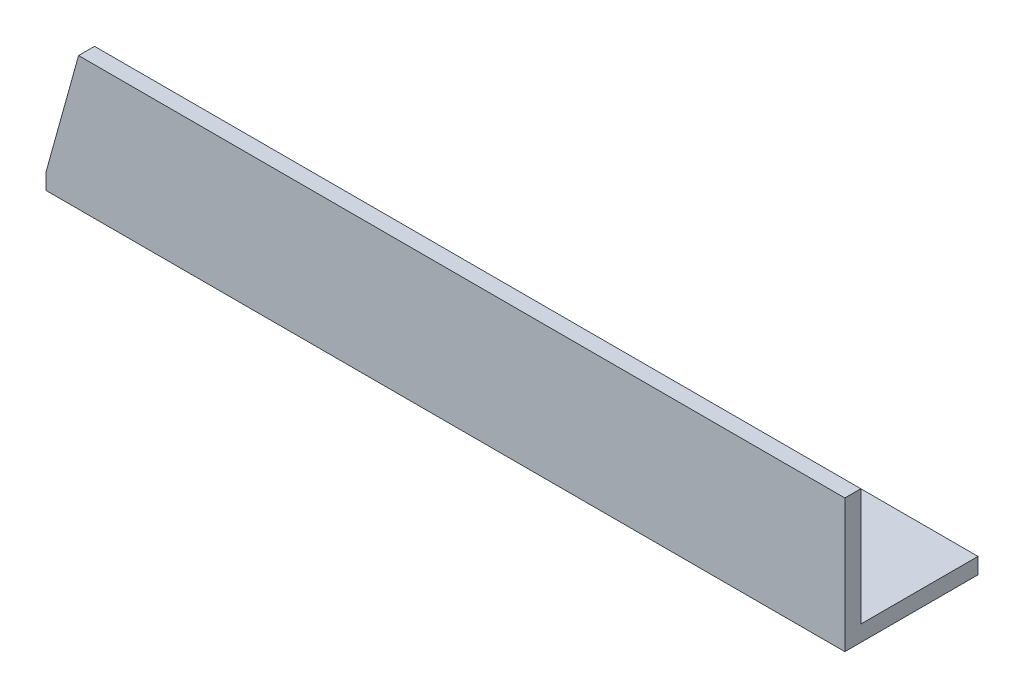
ISO-10303-21;
HEADER;
FILE_DESCRIPTION(('STEP AP214'),'2;1');
FILE_NAME('part.step','',(''),(''),'','','');
FILE_SCHEMA(('AUTOMOTIVE_DESIGN { 1 0 10303 214 1 1 1 1 }'));
ENDSEC;
DATA;
#1=APPLICATION_CONTEXT('core data for automotive mechanical design processes');
#2=APPLICATION_PROTOCOL_DEFINITION('international standard','automotive_design',2000,#1);
#3=PRODUCT_CONTEXT('',#1,'mechanical');
#4=PRODUCT('Part','Part','',(#3));
#5=PRODUCT_RELATED_PRODUCT_CATEGORY('part','',(#4));
#6=PRODUCT_DEFINITION_FORMATION('','',#4);
#7=PRODUCT_DEFINITION_CONTEXT('part definition',#1,'design');
#8=PRODUCT_DEFINITION('design','',#6,#7);
#9=PRODUCT_DEFINITION_SHAPE('','',#8);
#10=(LENGTH_UNIT() NAMED_UNIT(*) SI_UNIT(.MILLI.,.METRE.));
#11=(NAMED_UNIT(*) PLANE_ANGLE_UNIT() SI_UNIT($,.RADIAN.));
#12=(NAMED_UNIT(*) SI_UNIT($,.STERADIAN.) SOLID_ANGLE_UNIT());
#13=UNCERTAINTY_MEASURE_WITH_UNIT(LENGTH_MEASURE(1.E-05),#10,'distance_accuracy_value','');
#14=(GEOMETRIC_REPRESENTATION_CONTEXT(3) GLOBAL_UNCERTAINTY_ASSIGNED_CONTEXT((#13)) GLOBAL_UNIT_ASSIGNED_CONTEXT((#10,
#11,#12)) REPRESENTATION_CONTEXT('',''));
#15=CARTESIAN_POINT('',(0.,0.,0.));
#16=DIRECTION('',(0.,0.,1.));
#17=DIRECTION('',(1.,0.,0.));
#18=AXIS2_PLACEMENT_3D('',#15,#16,#17);
#19=CARTESIAN_POINT('',(300.,0.,0.));
#20=DIRECTION('',(0.,1.,0.));
#21=DIRECTION('',(0.,0.,1.));
#22=AXIS2_PLACEMENT_3D('',#19,#20,#21);
#23=PLANE('',#22);
#24=DIRECTION('',(0.,0.,-1.));
#25=VECTOR('',#24,1.);
#26=CARTESIAN_POINT('',(0.,0.,0.));
#27=LINE('',#26,#25);
#28=CARTESIAN_POINT('',(0.,0.,0.));
#29=VERTEX_POINT('',#28);
#30=CARTESIAN_POINT('',(0.,0.,-50.));
#31=VERTEX_POINT('',#30);
#32=EDGE_CURVE('E118',#29,#31,#27,.T.);
#33=ORIENTED_EDGE('',*,*,#32,.T.);
#34=DIRECTION('',(-1.,0.,0.));
#35=VECTOR('',#34,1.);
#36=CARTESIAN_POINT('',(300.,0.,-50.));
#37=LINE('',#36,#35);
#38=CARTESIAN_POINT('',(300.,0.,-50.));
#39=VERTEX_POINT('',#38);
#40=EDGE_CURVE('E42',#39,#31,#37,.T.);
#41=ORIENTED_EDGE('',*,*,#40,.F.);
#42=DIRECTION('',(0.,0.,-1.));
#43=VECTOR('',#42,1.);
#44=CARTESIAN_POINT('',(300.,0.,0.));
#45=LINE('',#44,#43);
#46=CARTESIAN_POINT('',(300.,0.,0.));
#47=VERTEX_POINT('',#46);
#48=EDGE_CURVE('E81',#47,#39,#45,.T.);
#49=ORIENTED_EDGE('',*,*,#48,.F.);
#50=DIRECTION('',(-1.,0.,0.));
#51=VECTOR('',#50,1.);
#52=CARTESIAN_POINT('',(300.,0.,0.));
#53=LINE('',#52,#51);
#54=EDGE_CURVE('E114',#47,#29,#53,.T.);
#55=ORIENTED_EDGE('',*,*,#54,.T.);
#56=EDGE_LOOP('',(#33,#41,#49,#55));
#57=FACE_BOUND('',#56,.T.);
#58=ADVANCED_FACE('F34',(#57),#23,.F.);
#59=CARTESIAN_POINT('',(300.,6.,-50.));
#60=DIRECTION('',(0.,0.,-1.));
#61=DIRECTION('',(-1.,0.,0.));
#62=AXIS2_PLACEMENT_3D('',#59,#60,#61);
#63=PLANE('',#62);
#64=DIRECTION('',(0.,-1.,0.));
#65=VECTOR('',#64,1.);
#66=CARTESIAN_POINT('',(0.,6.,-50.));
#67=LINE('',#66,#65);
#68=CARTESIAN_POINT('',(0.,6.,-50.));
#69=VERTEX_POINT('',#68);
#70=EDGE_CURVE('E121',#69,#31,#67,.T.);
#71=ORIENTED_EDGE('',*,*,#70,.F.);
#72=DIRECTION('',(-1.,0.,0.));
#73=VECTOR('',#72,1.);
#74=CARTESIAN_POINT('',(300.,6.,-50.));
#75=LINE('',#74,#73);
#76=CARTESIAN_POINT('',(300.,6.,-50.));
#77=VERTEX_POINT('',#76);
#78=EDGE_CURVE('E131',#77,#69,#75,.T.);
#79=ORIENTED_EDGE('',*,*,#78,.F.);
#80=DIRECTION('',(0.,-1.,0.));
#81=VECTOR('',#80,1.);
#82=CARTESIAN_POINT('',(300.,6.,-50.));
#83=LINE('',#82,#81);
#84=EDGE_CURVE('E136',#77,#39,#83,.T.);
#85=ORIENTED_EDGE('',*,*,#84,.T.);
#86=ORIENTED_EDGE('',*,*,#40,.T.);
#87=EDGE_LOOP('',(#71,#79,#85,#86));
#88=FACE_BOUND('',#87,.T.);
#89=ADVANCED_FACE('F135',(#88),#63,.T.);
#90=CARTESIAN_POINT('',(300.,6.,0.));
#91=DIRECTION('',(0.,1.,0.));
#92=DIRECTION('',(0.,0.,1.));
#93=AXIS2_PLACEMENT_3D('',#90,#91,#92);
#94=PLANE('',#93);
#95=DIRECTION('',(0.,0.,-1.));
#96=VECTOR('',#95,1.);
#97=CARTESIAN_POINT('',(0.,6.,0.));
#98=LINE('',#97,#96);
#99=CARTESIAN_POINT('',(0.,6.,-6.));
#100=VERTEX_POINT('',#99);
#101=EDGE_CURVE('E124',#100,#69,#98,.T.);
#102=ORIENTED_EDGE('',*,*,#101,.F.);
#103=DIRECTION('',(-1.,0.,0.));
#104=VECTOR('',#103,1.);
#105=CARTESIAN_POINT('',(300.,6.,-6.));
#106=LINE('',#105,#104);
#107=CARTESIAN_POINT('',(300.,6.,-6.));
#108=VERTEX_POINT('',#107);
#109=EDGE_CURVE('E102',#108,#100,#106,.T.);
#110=ORIENTED_EDGE('',*,*,#109,.F.);
#111=DIRECTION('',(0.,0.,-1.));
#112=VECTOR('',#111,1.);
#113=CARTESIAN_POINT('',(300.,6.,0.));
#114=LINE('',#113,#112);
#115=EDGE_CURVE('E109',#108,#77,#114,.T.);
#116=ORIENTED_EDGE('',*,*,#115,.T.);
#117=ORIENTED_EDGE('',*,*,#78,.T.);
#118=EDGE_LOOP('',(#102,#110,#116,#117));
#119=FACE_BOUND('',#118,.T.);
#120=ADVANCED_FACE('F143',(#119),#94,.T.);
#121=CARTESIAN_POINT('',(300.,50.,-6.));
#122=DIRECTION('',(0.,0.,-1.));
#123=DIRECTION('',(0.,1.,0.));
#124=AXIS2_PLACEMENT_3D('',#121,#122,#123);
#125=PLANE('',#124);
#126=DIRECTION('',(-0.267730580984136,-0.963493817315865,0.));
#127=VECTOR('',#126,1.);
#128=CARTESIAN_POINT('',(32.8539966155533,124.233122629639,-5.99999999999999));
#129=LINE('',#128,#127);
#130=CARTESIAN_POINT('',(12.2264879665959,50.,-6.));
#131=VERTEX_POINT('',#130);
#132=EDGE_CURVE('E68',#131,#100,#129,.T.);
#133=ORIENTED_EDGE('',*,*,#132,.F.);
#134=DIRECTION('',(-1.,0.,0.));
#135=VECTOR('',#134,1.);
#136=CARTESIAN_POINT('',(300.,50.,-6.));
#137=LINE('',#136,#135);
#138=CARTESIAN_POINT('',(300.,50.,-6.));
#139=VERTEX_POINT('',#138);
#140=EDGE_CURVE('E94',#139,#131,#137,.T.);
#141=ORIENTED_EDGE('',*,*,#140,.F.);
#142=DIRECTION('',(0.,-1.,0.));
#143=VECTOR('',#142,1.);
#144=CARTESIAN_POINT('',(300.,50.,-6.));
#145=LINE('',#144,#143);
#146=EDGE_CURVE('E98',#139,#108,#145,.T.);
#147=ORIENTED_EDGE('',*,*,#146,.T.);
#148=ORIENTED_EDGE('',*,*,#109,.T.);
#149=EDGE_LOOP('',(#133,#141,#147,#148));
#150=FACE_BOUND('',#149,.T.);
#151=ADVANCED_FACE('F96',(#150),#125,.T.);
#152=CARTESIAN_POINT('',(300.,50.,0.));
#153=DIRECTION('',(0.,1.,0.));
#154=DIRECTION('',(0.,0.,1.));
#155=AXIS2_PLACEMENT_3D('',#152,#153,#154);
#156=PLANE('',#155);
#157=DIRECTION('',(0.,0.,1.));
#158=VECTOR('',#157,1.);
#159=CARTESIAN_POINT('',(12.2264879665959,50.,-50.));
#160=LINE('',#159,#158);
#161=CARTESIAN_POINT('',(12.2264879665959,50.,0.));
#162=VERTEX_POINT('',#161);
#163=EDGE_CURVE('E148',#131,#162,#160,.T.);
#164=ORIENTED_EDGE('',*,*,#163,.T.);
#165=DIRECTION('',(-1.,0.,0.));
#166=VECTOR('',#165,1.);
#167=CARTESIAN_POINT('',(300.,50.,0.));
#168=LINE('',#167,#166);
#169=CARTESIAN_POINT('',(300.,50.,0.));
#170=VERTEX_POINT('',#169);
#171=EDGE_CURVE('E103',#170,#162,#168,.T.);
#172=ORIENTED_EDGE('',*,*,#171,.F.);
#173=DIRECTION('',(0.,0.,-1.));
#174=VECTOR('',#173,1.);
#175=CARTESIAN_POINT('',(300.,50.,0.));
#176=LINE('',#175,#174);
#177=EDGE_CURVE('E107',#170,#139,#176,.T.);
#178=ORIENTED_EDGE('',*,*,#177,.T.);
#179=ORIENTED_EDGE('',*,*,#140,.T.);
#180=EDGE_LOOP('',(#164,#172,#178,#179));
#181=FACE_BOUND('',#180,.T.);
#182=ADVANCED_FACE('F111',(#181),#156,.T.);
#183=CARTESIAN_POINT('',(300.,50.,0.));
#184=DIRECTION('',(0.,0.,-1.));
#185=DIRECTION('',(0.,1.,0.));
#186=AXIS2_PLACEMENT_3D('',#183,#184,#185);
#187=PLANE('',#186);
#188=ORIENTED_EDGE('',*,*,#171,.T.);
#189=DIRECTION('',(0.267730580984136,0.963493817315865,0.));
#190=VECTOR('',#189,1.);
#191=CARTESIAN_POINT('',(12.2264879665959,50.,0.));
#192=LINE('',#191,#190);
#193=CARTESIAN_POINT('',(0.,6.,0.));
#194=VERTEX_POINT('',#193);
#195=EDGE_CURVE('E150',#194,#162,#192,.T.);
#196=ORIENTED_EDGE('',*,*,#195,.F.);
#197=DIRECTION('',(0.,-1.,0.));
#198=VECTOR('',#197,1.);
#199=CARTESIAN_POINT('',(0.,50.,0.));
#200=LINE('',#199,#198);
#201=EDGE_CURVE('E75',#194,#29,#200,.T.);
#202=ORIENTED_EDGE('',*,*,#201,.T.);
#203=ORIENTED_EDGE('',*,*,#54,.F.);
#204=DIRECTION('',(0.,-1.,0.));
#205=VECTOR('',#204,1.);
#206=CARTESIAN_POINT('',(300.,50.,0.));
#207=LINE('',#206,#205);
#208=EDGE_CURVE('E50',#170,#47,#207,.T.);
#209=ORIENTED_EDGE('',*,*,#208,.F.);
#210=EDGE_LOOP('',(#188,#196,#202,#203,#209));
#211=FACE_BOUND('',#210,.T.);
#212=ADVANCED_FACE('F155',(#211),#187,.F.);
#213=CARTESIAN_POINT('',(300.,0.,0.));
#214=DIRECTION('',(-1.,0.,0.));
#215=DIRECTION('',(0.,0.,1.));
#216=AXIS2_PLACEMENT_3D('',#213,#214,#215);
#217=PLANE('',#216);
#218=ORIENTED_EDGE('',*,*,#48,.T.);
#219=ORIENTED_EDGE('',*,*,#84,.F.);
#220=ORIENTED_EDGE('',*,*,#115,.F.);
#221=ORIENTED_EDGE('',*,*,#146,.F.);
#222=ORIENTED_EDGE('',*,*,#177,.F.);
#223=ORIENTED_EDGE('',*,*,#208,.T.);
#224=EDGE_LOOP('',(#218,#219,#220,#221,#222,#223));
#225=FACE_BOUND('',#224,.T.);
#226=ADVANCED_FACE('F106',(#225),#217,.F.);
#227=CARTESIAN_POINT('',(0.,0.,0.));
#228=DIRECTION('',(-1.,0.,0.));
#229=DIRECTION('',(0.,0.,1.));
#230=AXIS2_PLACEMENT_3D('',#227,#228,#229);
#231=PLANE('',#230);
#232=DIRECTION('',(0.,0.,1.));
#233=VECTOR('',#232,1.);
#234=CARTESIAN_POINT('',(0.,6.,0.));
#235=LINE('',#234,#233);
#236=EDGE_CURVE('E11',#100,#194,#235,.T.);
#237=ORIENTED_EDGE('',*,*,#236,.F.);
#238=ORIENTED_EDGE('',*,*,#101,.T.);
#239=ORIENTED_EDGE('',*,*,#70,.T.);
#240=ORIENTED_EDGE('',*,*,#32,.F.);
#241=ORIENTED_EDGE('',*,*,#201,.F.);
#242=EDGE_LOOP('',(#237,#238,#239,#240,#241));
#243=FACE_BOUND('',#242,.T.);
#244=ADVANCED_FACE('F140',(#243),#231,.T.);
#245=CARTESIAN_POINT('',(12.2264879665959,50.,-50.));
#246=DIRECTION('',(0.963493817315865,-0.267730580984136,0.));
#247=DIRECTION('',(0.267730580984136,0.963493817315865,0.));
#248=AXIS2_PLACEMENT_3D('',#245,#246,#247);
#249=PLANE('',#248);
#250=ORIENTED_EDGE('',*,*,#132,.T.);
#251=ORIENTED_EDGE('',*,*,#236,.T.);
#252=ORIENTED_EDGE('',*,*,#195,.T.);
#253=ORIENTED_EDGE('',*,*,#163,.F.);
#254=EDGE_LOOP('',(#250,#251,#252,#253));
#255=FACE_BOUND('',#254,.T.);
#256=ADVANCED_FACE('F153',(#255),#249,.F.);
#257=CLOSED_SHELL('',(#58,#89,#120,#151,#182,#212,#226,#244,#256));
#258=MANIFOLD_SOLID_BREP('B2',#257);
#259=ADVANCED_BREP_SHAPE_REPRESENTATION('',(#18,#258),#14);
#260=SHAPE_DEFINITION_REPRESENTATION(#9,#259);
ENDSEC;
END-ISO-10303-21;
